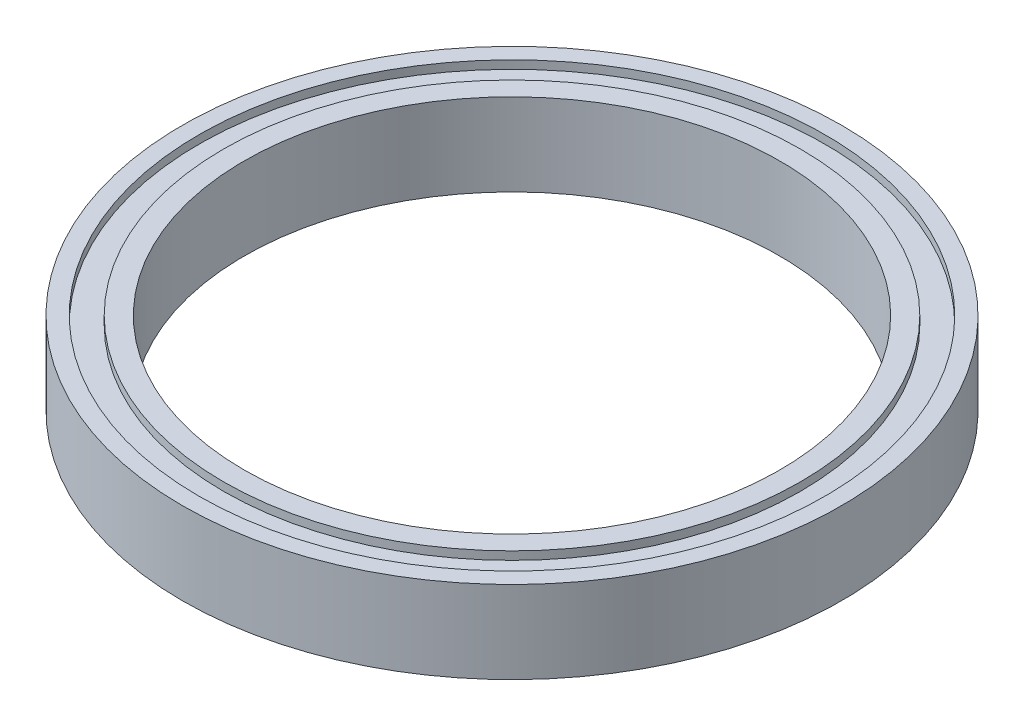
ISO-10303-21;
HEADER;
FILE_DESCRIPTION(('STEP AP214'),'2;1');
FILE_NAME('part.step','',(''),(''),'','','');
FILE_SCHEMA(('AUTOMOTIVE_DESIGN { 1 0 10303 214 1 1 1 1 }'));
ENDSEC;
DATA;
#1=APPLICATION_CONTEXT('core data for automotive mechanical design processes');
#2=APPLICATION_PROTOCOL_DEFINITION('international standard','automotive_design',2000,#1);
#3=PRODUCT_CONTEXT('',#1,'mechanical');
#4=PRODUCT('Part','Part','',(#3));
#5=PRODUCT_RELATED_PRODUCT_CATEGORY('part','',(#4));
#6=PRODUCT_DEFINITION_FORMATION('','',#4);
#7=PRODUCT_DEFINITION_CONTEXT('part definition',#1,'design');
#8=PRODUCT_DEFINITION('design','',#6,#7);
#9=PRODUCT_DEFINITION_SHAPE('','',#8);
#10=(LENGTH_UNIT() NAMED_UNIT(*) SI_UNIT(.MILLI.,.METRE.));
#11=(NAMED_UNIT(*) PLANE_ANGLE_UNIT() SI_UNIT($,.RADIAN.));
#12=(NAMED_UNIT(*) SI_UNIT($,.STERADIAN.) SOLID_ANGLE_UNIT());
#13=UNCERTAINTY_MEASURE_WITH_UNIT(LENGTH_MEASURE(1.E-05),#10,'distance_accuracy_value','');
#14=(GEOMETRIC_REPRESENTATION_CONTEXT(3) GLOBAL_UNCERTAINTY_ASSIGNED_CONTEXT((#13)) GLOBAL_UNIT_ASSIGNED_CONTEXT((#10,
#11,#12)) REPRESENTATION_CONTEXT('',''));
#15=CARTESIAN_POINT('',(0.,0.,0.));
#16=DIRECTION('',(0.,0.,1.));
#17=DIRECTION('',(1.,0.,0.));
#18=AXIS2_PLACEMENT_3D('',#15,#16,#17);
#19=CARTESIAN_POINT('',(-35.,16.3039282420188,0.));
#20=DIRECTION('',(0.,1.,0.));
#21=DIRECTION('',(0.,0.,1.));
#22=AXIS2_PLACEMENT_3D('',#19,#20,#21);
#23=PLANE('',#22);
#24=CARTESIAN_POINT('',(0.,16.3039282420188,0.));
#25=DIRECTION('',(0.,1.,0.));
#26=DIRECTION('',(0.,0.,1.));
#27=AXIS2_PLACEMENT_3D('',#24,#25,#26);
#28=CIRCLE('',#27,35.);
#29=CARTESIAN_POINT('',(0.,16.3039282420188,35.));
#30=VERTEX_POINT('',#29);
#31=EDGE_CURVE('E10',#30,#30,#28,.T.);
#32=ORIENTED_EDGE('',*,*,#31,.T.);
#33=EDGE_LOOP('',(#32));
#34=FACE_BOUND('',#33,.T.);
#35=CARTESIAN_POINT('',(0.,16.3039282420188,0.));
#36=DIRECTION('',(0.,1.,0.));
#37=DIRECTION('',(0.,0.,1.));
#38=AXIS2_PLACEMENT_3D('',#35,#36,#37);
#39=CIRCLE('',#38,32.5);
#40=CARTESIAN_POINT('',(0.,16.3039282420188,32.5));
#41=VERTEX_POINT('',#40);
#42=EDGE_CURVE('E88',#41,#41,#39,.T.);
#43=ORIENTED_EDGE('',*,*,#42,.F.);
#44=EDGE_LOOP('',(#43));
#45=FACE_BOUND('',#44,.T.);
#46=ADVANCED_FACE('F37',(#34,#45),#23,.T.);
#47=CARTESIAN_POINT('',(0.,37.4803715656772,0.));
#48=DIRECTION('',(0.,1.,0.));
#49=DIRECTION('',(0.,0.,1.));
#50=AXIS2_PLACEMENT_3D('',#47,#48,#49);
#51=CYLINDRICAL_SURFACE('',#50,35.);
#52=CARTESIAN_POINT('',(0.,15.3039282420188,0.));
#53=DIRECTION('',(0.,1.,0.));
#54=DIRECTION('',(0.,0.,1.));
#55=AXIS2_PLACEMENT_3D('',#52,#53,#54);
#56=CIRCLE('',#55,35.);
#57=CARTESIAN_POINT('',(0.,15.3039282420188,35.));
#58=VERTEX_POINT('',#57);
#59=EDGE_CURVE('E44',#58,#58,#56,.T.);
#60=ORIENTED_EDGE('',*,*,#59,.T.);
#61=EDGE_LOOP('',(#60));
#62=FACE_BOUND('',#61,.T.);
#63=ORIENTED_EDGE('',*,*,#31,.F.);
#64=EDGE_LOOP('',(#63));
#65=FACE_BOUND('',#64,.T.);
#66=ADVANCED_FACE('F97',(#62,#65),#51,.T.);
#67=CARTESIAN_POINT('',(-38.,15.3039282420188,0.));
#68=DIRECTION('',(0.,1.,0.));
#69=DIRECTION('',(0.,0.,1.));
#70=AXIS2_PLACEMENT_3D('',#67,#68,#69);
#71=PLANE('',#70);
#72=CARTESIAN_POINT('',(0.,15.3039282420188,0.));
#73=DIRECTION('',(0.,1.,0.));
#74=DIRECTION('',(0.,0.,1.));
#75=AXIS2_PLACEMENT_3D('',#72,#73,#74);
#76=CIRCLE('',#75,38.);
#77=CARTESIAN_POINT('',(0.,15.3039282420188,38.));
#78=VERTEX_POINT('',#77);
#79=EDGE_CURVE('E49',#78,#78,#76,.T.);
#80=ORIENTED_EDGE('',*,*,#79,.T.);
#81=EDGE_LOOP('',(#80));
#82=FACE_BOUND('',#81,.T.);
#83=ORIENTED_EDGE('',*,*,#59,.F.);
#84=EDGE_LOOP('',(#83));
#85=FACE_BOUND('',#84,.T.);
#86=ADVANCED_FACE('F101',(#82,#85),#71,.T.);
#87=CARTESIAN_POINT('',(0.,37.4803715656772,0.));
#88=DIRECTION('',(0.,1.,0.));
#89=DIRECTION('',(0.,0.,1.));
#90=AXIS2_PLACEMENT_3D('',#87,#88,#89);
#91=CYLINDRICAL_SURFACE('',#90,38.);
#92=CARTESIAN_POINT('',(0.,16.3039282420188,0.));
#93=DIRECTION('',(0.,1.,0.));
#94=DIRECTION('',(0.,0.,1.));
#95=AXIS2_PLACEMENT_3D('',#92,#93,#94);
#96=CIRCLE('',#95,38.);
#97=CARTESIAN_POINT('',(0.,16.3039282420188,38.));
#98=VERTEX_POINT('',#97);
#99=EDGE_CURVE('E54',#98,#98,#96,.T.);
#100=ORIENTED_EDGE('',*,*,#99,.T.);
#101=EDGE_LOOP('',(#100));
#102=FACE_BOUND('',#101,.T.);
#103=ORIENTED_EDGE('',*,*,#79,.F.);
#104=EDGE_LOOP('',(#103));
#105=FACE_BOUND('',#104,.T.);
#106=ADVANCED_FACE('F105',(#102,#105),#91,.F.);
#107=CARTESIAN_POINT('',(-40.,16.3039282420188,0.));
#108=DIRECTION('',(0.,1.,0.));
#109=DIRECTION('',(0.,0.,1.));
#110=AXIS2_PLACEMENT_3D('',#107,#108,#109);
#111=PLANE('',#110);
#112=CARTESIAN_POINT('',(0.,16.3039282420188,0.));
#113=DIRECTION('',(0.,1.,0.));
#114=DIRECTION('',(0.,0.,1.));
#115=AXIS2_PLACEMENT_3D('',#112,#113,#114);
#116=CIRCLE('',#115,40.);
#117=CARTESIAN_POINT('',(0.,16.3039282420188,40.));
#118=VERTEX_POINT('',#117);
#119=EDGE_CURVE('E60',#118,#118,#116,.T.);
#120=ORIENTED_EDGE('',*,*,#119,.T.);
#121=EDGE_LOOP('',(#120));
#122=FACE_BOUND('',#121,.T.);
#123=ORIENTED_EDGE('',*,*,#99,.F.);
#124=EDGE_LOOP('',(#123));
#125=FACE_BOUND('',#124,.T.);
#126=ADVANCED_FACE('F112',(#122,#125),#111,.T.);
#127=CARTESIAN_POINT('',(0.,37.4803715656772,0.));
#128=DIRECTION('',(0.,1.,0.));
#129=DIRECTION('',(0.,0.,1.));
#130=AXIS2_PLACEMENT_3D('',#127,#128,#129);
#131=CYLINDRICAL_SURFACE('',#130,40.);
#132=CARTESIAN_POINT('',(0.,6.30392824201879,0.));
#133=DIRECTION('',(0.,1.,0.));
#134=DIRECTION('',(0.,0.,1.));
#135=AXIS2_PLACEMENT_3D('',#132,#133,#134);
#136=CIRCLE('',#135,40.);
#137=CARTESIAN_POINT('',(0.,6.30392824201879,40.));
#138=VERTEX_POINT('',#137);
#139=EDGE_CURVE('E64',#138,#138,#136,.T.);
#140=ORIENTED_EDGE('',*,*,#139,.T.);
#141=EDGE_LOOP('',(#140));
#142=FACE_BOUND('',#141,.T.);
#143=ORIENTED_EDGE('',*,*,#119,.F.);
#144=EDGE_LOOP('',(#143));
#145=FACE_BOUND('',#144,.T.);
#146=ADVANCED_FACE('F116',(#142,#145),#131,.T.);
#147=CARTESIAN_POINT('',(-40.,6.30392824201879,0.));
#148=DIRECTION('',(0.,-1.,0.));
#149=DIRECTION('',(0.,0.,-1.));
#150=AXIS2_PLACEMENT_3D('',#147,#148,#149);
#151=PLANE('',#150);
#152=CARTESIAN_POINT('',(0.,6.30392824201879,0.));
#153=DIRECTION('',(0.,1.,0.));
#154=DIRECTION('',(0.,0.,1.));
#155=AXIS2_PLACEMENT_3D('',#152,#153,#154);
#156=CIRCLE('',#155,38.);
#157=CARTESIAN_POINT('',(0.,6.30392824201879,38.));
#158=VERTEX_POINT('',#157);
#159=EDGE_CURVE('E68',#158,#158,#156,.T.);
#160=ORIENTED_EDGE('',*,*,#159,.T.);
#161=EDGE_LOOP('',(#160));
#162=FACE_BOUND('',#161,.T.);
#163=ORIENTED_EDGE('',*,*,#139,.F.);
#164=EDGE_LOOP('',(#163));
#165=FACE_BOUND('',#164,.T.);
#166=ADVANCED_FACE('F120',(#162,#165),#151,.T.);
#167=CARTESIAN_POINT('',(0.,37.4803715656772,0.));
#168=DIRECTION('',(0.,1.,0.));
#169=DIRECTION('',(0.,0.,1.));
#170=AXIS2_PLACEMENT_3D('',#167,#168,#169);
#171=CYLINDRICAL_SURFACE('',#170,38.);
#172=CARTESIAN_POINT('',(0.,7.30392824201878,0.));
#173=DIRECTION('',(0.,1.,0.));
#174=DIRECTION('',(0.,0.,1.));
#175=AXIS2_PLACEMENT_3D('',#172,#173,#174);
#176=CIRCLE('',#175,38.);
#177=CARTESIAN_POINT('',(0.,7.30392824201878,38.));
#178=VERTEX_POINT('',#177);
#179=EDGE_CURVE('E72',#178,#178,#176,.T.);
#180=ORIENTED_EDGE('',*,*,#179,.T.);
#181=EDGE_LOOP('',(#180));
#182=FACE_BOUND('',#181,.T.);
#183=ORIENTED_EDGE('',*,*,#159,.F.);
#184=EDGE_LOOP('',(#183));
#185=FACE_BOUND('',#184,.T.);
#186=ADVANCED_FACE('F124',(#182,#185),#171,.F.);
#187=CARTESIAN_POINT('',(-38.,7.30392824201878,0.));
#188=DIRECTION('',(0.,-1.,0.));
#189=DIRECTION('',(0.,0.,-1.));
#190=AXIS2_PLACEMENT_3D('',#187,#188,#189);
#191=PLANE('',#190);
#192=CARTESIAN_POINT('',(0.,7.30392824201878,0.));
#193=DIRECTION('',(0.,1.,0.));
#194=DIRECTION('',(0.,0.,1.));
#195=AXIS2_PLACEMENT_3D('',#192,#193,#194);
#196=CIRCLE('',#195,35.);
#197=CARTESIAN_POINT('',(0.,7.30392824201878,35.));
#198=VERTEX_POINT('',#197);
#199=EDGE_CURVE('E76',#198,#198,#196,.T.);
#200=ORIENTED_EDGE('',*,*,#199,.T.);
#201=EDGE_LOOP('',(#200));
#202=FACE_BOUND('',#201,.T.);
#203=ORIENTED_EDGE('',*,*,#179,.F.);
#204=EDGE_LOOP('',(#203));
#205=FACE_BOUND('',#204,.T.);
#206=ADVANCED_FACE('F128',(#202,#205),#191,.T.);
#207=CARTESIAN_POINT('',(0.,37.4803715656772,0.));
#208=DIRECTION('',(0.,1.,0.));
#209=DIRECTION('',(0.,0.,1.));
#210=AXIS2_PLACEMENT_3D('',#207,#208,#209);
#211=CYLINDRICAL_SURFACE('',#210,35.);
#212=CARTESIAN_POINT('',(0.,6.30392824201879,0.));
#213=DIRECTION('',(0.,1.,0.));
#214=DIRECTION('',(0.,0.,1.));
#215=AXIS2_PLACEMENT_3D('',#212,#213,#214);
#216=CIRCLE('',#215,35.);
#217=CARTESIAN_POINT('',(0.,6.30392824201879,35.));
#218=VERTEX_POINT('',#217);
#219=EDGE_CURVE('E80',#218,#218,#216,.T.);
#220=ORIENTED_EDGE('',*,*,#219,.T.);
#221=EDGE_LOOP('',(#220));
#222=FACE_BOUND('',#221,.T.);
#223=ORIENTED_EDGE('',*,*,#199,.F.);
#224=EDGE_LOOP('',(#223));
#225=FACE_BOUND('',#224,.T.);
#226=ADVANCED_FACE('F132',(#222,#225),#211,.T.);
#227=CARTESIAN_POINT('',(-35.,6.30392824201879,0.));
#228=DIRECTION('',(0.,-1.,0.));
#229=DIRECTION('',(0.,0.,-1.));
#230=AXIS2_PLACEMENT_3D('',#227,#228,#229);
#231=PLANE('',#230);
#232=CARTESIAN_POINT('',(0.,6.30392824201879,0.));
#233=DIRECTION('',(0.,1.,0.));
#234=DIRECTION('',(0.,0.,1.));
#235=AXIS2_PLACEMENT_3D('',#232,#233,#234);
#236=CIRCLE('',#235,32.5);
#237=CARTESIAN_POINT('',(0.,6.30392824201879,32.5));
#238=VERTEX_POINT('',#237);
#239=EDGE_CURVE('E84',#238,#238,#236,.T.);
#240=ORIENTED_EDGE('',*,*,#239,.T.);
#241=EDGE_LOOP('',(#240));
#242=FACE_BOUND('',#241,.T.);
#243=ORIENTED_EDGE('',*,*,#219,.F.);
#244=EDGE_LOOP('',(#243));
#245=FACE_BOUND('',#244,.T.);
#246=ADVANCED_FACE('F136',(#242,#245),#231,.T.);
#247=CARTESIAN_POINT('',(0.,37.4803715656772,0.));
#248=DIRECTION('',(0.,1.,0.));
#249=DIRECTION('',(0.,0.,1.));
#250=AXIS2_PLACEMENT_3D('',#247,#248,#249);
#251=CYLINDRICAL_SURFACE('',#250,32.5);
#252=ORIENTED_EDGE('',*,*,#42,.T.);
#253=EDGE_LOOP('',(#252));
#254=FACE_BOUND('',#253,.T.);
#255=ORIENTED_EDGE('',*,*,#239,.F.);
#256=EDGE_LOOP('',(#255));
#257=FACE_BOUND('',#256,.T.);
#258=ADVANCED_FACE('F93',(#254,#257),#251,.F.);
#259=CLOSED_SHELL('',(#46,#66,#86,#106,#126,#146,#166,#186,#206,#226,#246,#258));
#260=MANIFOLD_SOLID_BREP('B2',#259);
#261=ADVANCED_BREP_SHAPE_REPRESENTATION('',(#18,#260),#14);
#262=SHAPE_DEFINITION_REPRESENTATION(#9,#261);
ENDSEC;
END-ISO-10303-21;
